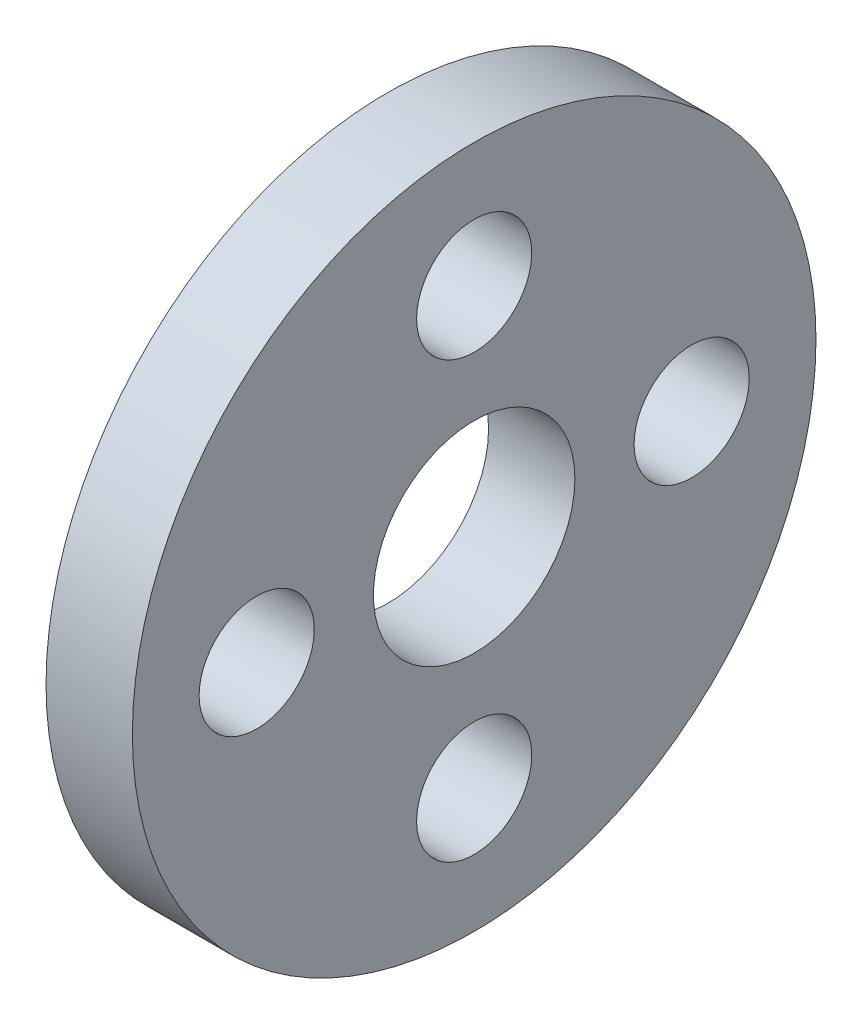
ISO-10303-21;
HEADER;
FILE_DESCRIPTION(('STEP AP214'),'2;1');
FILE_NAME('part.step','',(''),(''),'','','');
FILE_SCHEMA(('AUTOMOTIVE_DESIGN { 1 0 10303 214 1 1 1 1 }'));
ENDSEC;
DATA;
#1=APPLICATION_CONTEXT('core data for automotive mechanical design processes');
#2=APPLICATION_PROTOCOL_DEFINITION('international standard','automotive_design',2000,#1);
#3=PRODUCT_CONTEXT('',#1,'mechanical');
#4=PRODUCT('Part','Part','',(#3));
#5=PRODUCT_RELATED_PRODUCT_CATEGORY('part','',(#4));
#6=PRODUCT_DEFINITION_FORMATION('','',#4);
#7=PRODUCT_DEFINITION_CONTEXT('part definition',#1,'design');
#8=PRODUCT_DEFINITION('design','',#6,#7);
#9=PRODUCT_DEFINITION_SHAPE('','',#8);
#10=(LENGTH_UNIT() NAMED_UNIT(*) SI_UNIT(.MILLI.,.METRE.));
#11=(NAMED_UNIT(*) PLANE_ANGLE_UNIT() SI_UNIT($,.RADIAN.));
#12=(NAMED_UNIT(*) SI_UNIT($,.STERADIAN.) SOLID_ANGLE_UNIT());
#13=UNCERTAINTY_MEASURE_WITH_UNIT(LENGTH_MEASURE(1.E-05),#10,'distance_accuracy_value','');
#14=(GEOMETRIC_REPRESENTATION_CONTEXT(3) GLOBAL_UNCERTAINTY_ASSIGNED_CONTEXT((#13)) GLOBAL_UNIT_ASSIGNED_CONTEXT((#10,
#11,#12)) REPRESENTATION_CONTEXT('',''));
#15=CARTESIAN_POINT('',(0.,0.,0.));
#16=DIRECTION('',(0.,0.,1.));
#17=DIRECTION('',(1.,0.,0.));
#18=AXIS2_PLACEMENT_3D('',#15,#16,#17);
#19=CARTESIAN_POINT('',(12.,0.,30.225));
#20=DIRECTION('',(-1.,0.,0.));
#21=DIRECTION('',(0.,0.,1.));
#22=AXIS2_PLACEMENT_3D('',#19,#20,#21);
#23=CYLINDRICAL_SURFACE('',#22,8.);
#24=CARTESIAN_POINT('',(12.,0.,30.225));
#25=DIRECTION('',(-1.,0.,0.));
#26=DIRECTION('',(0.,0.,1.));
#27=AXIS2_PLACEMENT_3D('',#24,#25,#26);
#28=CIRCLE('',#27,8.);
#29=CARTESIAN_POINT('',(12.,0.,38.225));
#30=VERTEX_POINT('',#29);
#31=EDGE_CURVE('E39',#30,#30,#28,.T.);
#32=ORIENTED_EDGE('',*,*,#31,.F.);
#33=EDGE_LOOP('',(#32));
#34=FACE_BOUND('',#33,.T.);
#35=CARTESIAN_POINT('',(0.,0.,30.225));
#36=DIRECTION('',(-1.,0.,0.));
#37=DIRECTION('',(0.,0.,1.));
#38=AXIS2_PLACEMENT_3D('',#35,#36,#37);
#39=CIRCLE('',#38,8.);
#40=CARTESIAN_POINT('',(0.,0.,38.225));
#41=VERTEX_POINT('',#40);
#42=EDGE_CURVE('E16',#41,#41,#39,.F.);
#43=ORIENTED_EDGE('',*,*,#42,.F.);
#44=EDGE_LOOP('',(#43));
#45=FACE_BOUND('',#44,.T.);
#46=ADVANCED_FACE('F13',(#34,#45),#23,.F.);
#47=CARTESIAN_POINT('',(12.,-30.225,0.));
#48=DIRECTION('',(-1.,0.,0.));
#49=DIRECTION('',(0.,0.,1.));
#50=AXIS2_PLACEMENT_3D('',#47,#48,#49);
#51=CYLINDRICAL_SURFACE('',#50,8.);
#52=CARTESIAN_POINT('',(12.,-30.225,0.));
#53=DIRECTION('',(-1.,0.,0.));
#54=DIRECTION('',(0.,0.,1.));
#55=AXIS2_PLACEMENT_3D('',#52,#53,#54);
#56=CIRCLE('',#55,8.);
#57=CARTESIAN_POINT('',(12.,-30.225,8.));
#58=VERTEX_POINT('',#57);
#59=EDGE_CURVE('E36',#58,#58,#56,.T.);
#60=ORIENTED_EDGE('',*,*,#59,.F.);
#61=EDGE_LOOP('',(#60));
#62=FACE_BOUND('',#61,.T.);
#63=CARTESIAN_POINT('',(0.,-30.225,0.));
#64=DIRECTION('',(-1.,0.,0.));
#65=DIRECTION('',(0.,0.,1.));
#66=AXIS2_PLACEMENT_3D('',#63,#64,#65);
#67=CIRCLE('',#66,8.);
#68=CARTESIAN_POINT('',(0.,-30.225,8.));
#69=VERTEX_POINT('',#68);
#70=EDGE_CURVE('E50',#69,#69,#67,.F.);
#71=ORIENTED_EDGE('',*,*,#70,.F.);
#72=EDGE_LOOP('',(#71));
#73=FACE_BOUND('',#72,.T.);
#74=ADVANCED_FACE('F61',(#62,#73),#51,.F.);
#75=CARTESIAN_POINT('',(12.,0.,-30.225));
#76=DIRECTION('',(-1.,0.,0.));
#77=DIRECTION('',(0.,0.,1.));
#78=AXIS2_PLACEMENT_3D('',#75,#76,#77);
#79=CYLINDRICAL_SURFACE('',#78,8.);
#80=CARTESIAN_POINT('',(12.,0.,-30.225));
#81=DIRECTION('',(-1.,0.,0.));
#82=DIRECTION('',(0.,0.,1.));
#83=AXIS2_PLACEMENT_3D('',#80,#81,#82);
#84=CIRCLE('',#83,8.);
#85=CARTESIAN_POINT('',(12.,0.,-22.225));
#86=VERTEX_POINT('',#85);
#87=EDGE_CURVE('E33',#86,#86,#84,.T.);
#88=ORIENTED_EDGE('',*,*,#87,.F.);
#89=EDGE_LOOP('',(#88));
#90=FACE_BOUND('',#89,.T.);
#91=CARTESIAN_POINT('',(0.,0.,-30.225));
#92=DIRECTION('',(-1.,0.,0.));
#93=DIRECTION('',(0.,0.,1.));
#94=AXIS2_PLACEMENT_3D('',#91,#92,#93);
#95=CIRCLE('',#94,8.);
#96=CARTESIAN_POINT('',(0.,0.,-22.225));
#97=VERTEX_POINT('',#96);
#98=EDGE_CURVE('E48',#97,#97,#95,.F.);
#99=ORIENTED_EDGE('',*,*,#98,.F.);
#100=EDGE_LOOP('',(#99));
#101=FACE_BOUND('',#100,.T.);
#102=ADVANCED_FACE('F67',(#90,#101),#79,.F.);
#103=CARTESIAN_POINT('',(12.,30.225,0.));
#104=DIRECTION('',(-1.,0.,0.));
#105=DIRECTION('',(0.,0.,1.));
#106=AXIS2_PLACEMENT_3D('',#103,#104,#105);
#107=CYLINDRICAL_SURFACE('',#106,8.00000000000001);
#108=CARTESIAN_POINT('',(12.,30.225,0.));
#109=DIRECTION('',(-1.,0.,0.));
#110=DIRECTION('',(0.,0.,1.));
#111=AXIS2_PLACEMENT_3D('',#108,#109,#110);
#112=CIRCLE('',#111,8.00000000000001);
#113=CARTESIAN_POINT('',(12.,30.225,8.00000000000001));
#114=VERTEX_POINT('',#113);
#115=EDGE_CURVE('E30',#114,#114,#112,.T.);
#116=ORIENTED_EDGE('',*,*,#115,.F.);
#117=EDGE_LOOP('',(#116));
#118=FACE_BOUND('',#117,.T.);
#119=CARTESIAN_POINT('',(0.,30.225,0.));
#120=DIRECTION('',(-1.,0.,0.));
#121=DIRECTION('',(0.,0.,1.));
#122=AXIS2_PLACEMENT_3D('',#119,#120,#121);
#123=CIRCLE('',#122,8.00000000000001);
#124=CARTESIAN_POINT('',(0.,30.225,8.00000000000001));
#125=VERTEX_POINT('',#124);
#126=EDGE_CURVE('E45',#125,#125,#123,.F.);
#127=ORIENTED_EDGE('',*,*,#126,.F.);
#128=EDGE_LOOP('',(#127));
#129=FACE_BOUND('',#128,.T.);
#130=ADVANCED_FACE('F87',(#118,#129),#107,.F.);
#131=CARTESIAN_POINT('',(0.,0.,0.));
#132=DIRECTION('',(1.,0.,0.));
#133=DIRECTION('',(0.,0.,-1.));
#134=AXIS2_PLACEMENT_3D('',#131,#132,#133);
#135=CYLINDRICAL_SURFACE('',#134,14.);
#136=CARTESIAN_POINT('',(0.,0.,0.));
#137=DIRECTION('',(1.,0.,0.));
#138=DIRECTION('',(0.,0.,-1.));
#139=AXIS2_PLACEMENT_3D('',#136,#137,#138);
#140=CIRCLE('',#139,14.);
#141=CARTESIAN_POINT('',(0.,0.,-14.));
#142=VERTEX_POINT('',#141);
#143=EDGE_CURVE('E42',#142,#142,#140,.T.);
#144=ORIENTED_EDGE('',*,*,#143,.F.);
#145=EDGE_LOOP('',(#144));
#146=FACE_BOUND('',#145,.T.);
#147=CARTESIAN_POINT('',(12.,0.,0.));
#148=DIRECTION('',(1.,0.,0.));
#149=DIRECTION('',(0.,0.,-1.));
#150=AXIS2_PLACEMENT_3D('',#147,#148,#149);
#151=CIRCLE('',#150,14.);
#152=CARTESIAN_POINT('',(12.,0.,-14.));
#153=VERTEX_POINT('',#152);
#154=EDGE_CURVE('E25',#153,#153,#151,.F.);
#155=ORIENTED_EDGE('',*,*,#154,.F.);
#156=EDGE_LOOP('',(#155));
#157=FACE_BOUND('',#156,.T.);
#158=ADVANCED_FACE('F83',(#146,#157),#135,.F.);
#159=CARTESIAN_POINT('',(0.,-48.0700021082915,-47.5));
#160=DIRECTION('',(-1.,0.,0.));
#161=DIRECTION('',(0.,0.,1.));
#162=AXIS2_PLACEMENT_3D('',#159,#160,#161);
#163=PLANE('',#162);
#164=ORIENTED_EDGE('',*,*,#143,.T.);
#165=EDGE_LOOP('',(#164));
#166=FACE_BOUND('',#165,.T.);
#167=ORIENTED_EDGE('',*,*,#126,.T.);
#168=EDGE_LOOP('',(#167));
#169=FACE_BOUND('',#168,.T.);
#170=ORIENTED_EDGE('',*,*,#98,.T.);
#171=EDGE_LOOP('',(#170));
#172=FACE_BOUND('',#171,.T.);
#173=ORIENTED_EDGE('',*,*,#70,.T.);
#174=EDGE_LOOP('',(#173));
#175=FACE_BOUND('',#174,.T.);
#176=ORIENTED_EDGE('',*,*,#42,.T.);
#177=EDGE_LOOP('',(#176));
#178=FACE_BOUND('',#177,.T.);
#179=CARTESIAN_POINT('',(0.,0.,0.));
#180=DIRECTION('',(1.,0.,0.));
#181=DIRECTION('',(0.,0.,-1.));
#182=AXIS2_PLACEMENT_3D('',#179,#180,#181);
#183=CIRCLE('',#182,47.5);
#184=CARTESIAN_POINT('',(0.,0.,-47.5));
#185=VERTEX_POINT('',#184);
#186=EDGE_CURVE('E20',#185,#185,#183,.T.);
#187=ORIENTED_EDGE('',*,*,#186,.F.);
#188=EDGE_LOOP('',(#187));
#189=FACE_BOUND('',#188,.T.);
#190=ADVANCED_FACE('F57',(#166,#169,#172,#175,#178,#189),#163,.T.);
#191=CARTESIAN_POINT('',(12.,-48.0700021082915,47.5));
#192=DIRECTION('',(1.,0.,0.));
#193=DIRECTION('',(0.,0.,-1.));
#194=AXIS2_PLACEMENT_3D('',#191,#192,#193);
#195=PLANE('',#194);
#196=ORIENTED_EDGE('',*,*,#154,.T.);
#197=EDGE_LOOP('',(#196));
#198=FACE_BOUND('',#197,.T.);
#199=ORIENTED_EDGE('',*,*,#115,.T.);
#200=EDGE_LOOP('',(#199));
#201=FACE_BOUND('',#200,.T.);
#202=ORIENTED_EDGE('',*,*,#87,.T.);
#203=EDGE_LOOP('',(#202));
#204=FACE_BOUND('',#203,.T.);
#205=ORIENTED_EDGE('',*,*,#59,.T.);
#206=EDGE_LOOP('',(#205));
#207=FACE_BOUND('',#206,.T.);
#208=ORIENTED_EDGE('',*,*,#31,.T.);
#209=EDGE_LOOP('',(#208));
#210=FACE_BOUND('',#209,.T.);
#211=CARTESIAN_POINT('',(12.,0.,0.));
#212=DIRECTION('',(1.,0.,0.));
#213=DIRECTION('',(0.,0.,-1.));
#214=AXIS2_PLACEMENT_3D('',#211,#212,#213);
#215=CIRCLE('',#214,47.5);
#216=CARTESIAN_POINT('',(12.,0.,-47.5));
#217=VERTEX_POINT('',#216);
#218=EDGE_CURVE('E8',#217,#217,#215,.F.);
#219=ORIENTED_EDGE('',*,*,#218,.F.);
#220=EDGE_LOOP('',(#219));
#221=FACE_BOUND('',#220,.T.);
#222=ADVANCED_FACE('F72',(#198,#201,#204,#207,#210,#221),#195,.T.);
#223=CARTESIAN_POINT('',(12.,0.,0.));
#224=DIRECTION('',(1.,0.,0.));
#225=DIRECTION('',(0.,0.,-1.));
#226=AXIS2_PLACEMENT_3D('',#223,#224,#225);
#227=CYLINDRICAL_SURFACE('',#226,47.5);
#228=ORIENTED_EDGE('',*,*,#186,.T.);
#229=EDGE_LOOP('',(#228));
#230=FACE_BOUND('',#229,.T.);
#231=ORIENTED_EDGE('',*,*,#218,.T.);
#232=EDGE_LOOP('',(#231));
#233=FACE_BOUND('',#232,.T.);
#234=ADVANCED_FACE('F70',(#230,#233),#227,.T.);
#235=CLOSED_SHELL('',(#46,#74,#102,#130,#158,#190,#222,#234));
#236=MANIFOLD_SOLID_BREP('B1',#235);
#237=ADVANCED_BREP_SHAPE_REPRESENTATION('',(#18,#236),#14);
#238=SHAPE_DEFINITION_REPRESENTATION(#9,#237);
ENDSEC;
END-ISO-10303-21;
